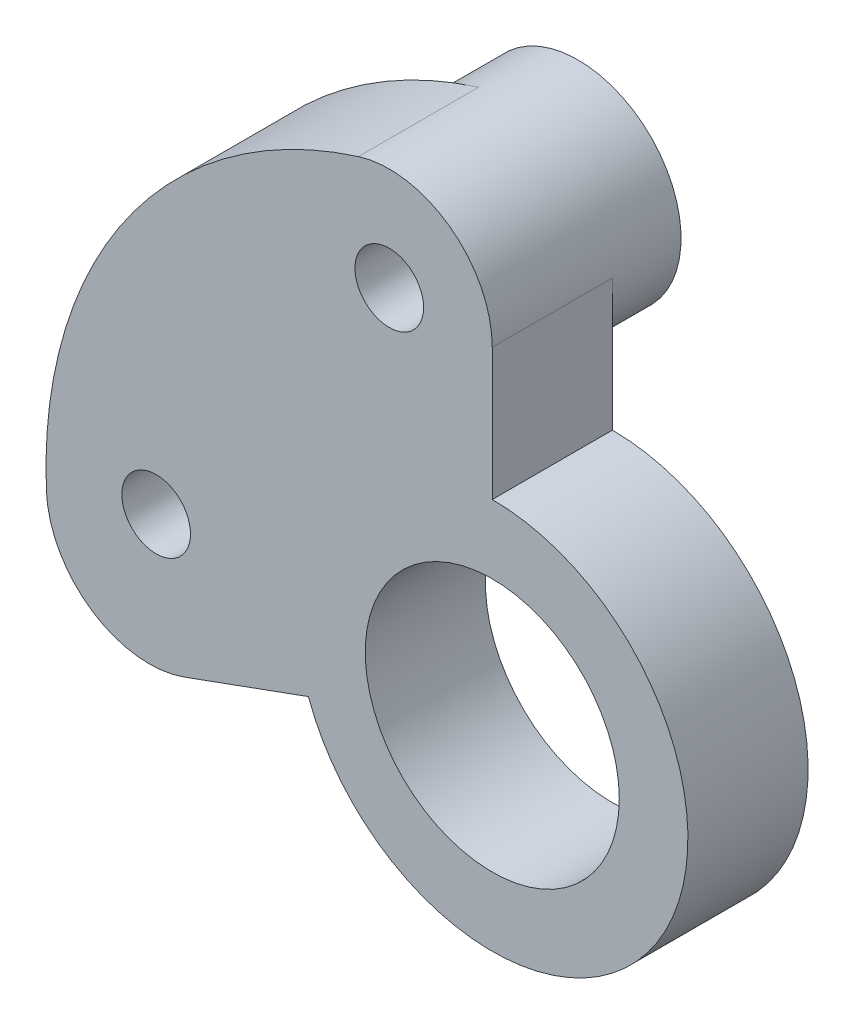
ISO-10303-21;
HEADER;
FILE_DESCRIPTION(('STEP AP214'),'2;1');
FILE_NAME('part.step','',(''),(''),'','','');
FILE_SCHEMA(('AUTOMOTIVE_DESIGN { 1 0 10303 214 1 1 1 1 }'));
ENDSEC;
DATA;
#1=APPLICATION_CONTEXT('core data for automotive mechanical design processes');
#2=APPLICATION_PROTOCOL_DEFINITION('international standard','automotive_design',2000,#1);
#3=PRODUCT_CONTEXT('',#1,'mechanical');
#4=PRODUCT('Part','Part','',(#3));
#5=PRODUCT_RELATED_PRODUCT_CATEGORY('part','',(#4));
#6=PRODUCT_DEFINITION_FORMATION('','',#4);
#7=PRODUCT_DEFINITION_CONTEXT('part definition',#1,'design');
#8=PRODUCT_DEFINITION('design','',#6,#7);
#9=PRODUCT_DEFINITION_SHAPE('','',#8);
#10=(LENGTH_UNIT() NAMED_UNIT(*) SI_UNIT(.MILLI.,.METRE.));
#11=(NAMED_UNIT(*) PLANE_ANGLE_UNIT() SI_UNIT($,.RADIAN.));
#12=(NAMED_UNIT(*) SI_UNIT($,.STERADIAN.) SOLID_ANGLE_UNIT());
#13=UNCERTAINTY_MEASURE_WITH_UNIT(LENGTH_MEASURE(1.E-05),#10,'distance_accuracy_value','');
#14=(GEOMETRIC_REPRESENTATION_CONTEXT(3) GLOBAL_UNCERTAINTY_ASSIGNED_CONTEXT((#13)) GLOBAL_UNIT_ASSIGNED_CONTEXT((#10,
#11,#12)) REPRESENTATION_CONTEXT('',''));
#15=CARTESIAN_POINT('',(0.,0.,0.));
#16=DIRECTION('',(0.,0.,1.));
#17=DIRECTION('',(1.,0.,0.));
#18=AXIS2_PLACEMENT_3D('',#15,#16,#17);
#19=CARTESIAN_POINT('',(0.,0.,0.));
#20=DIRECTION('',(0.,0.,1.));
#21=DIRECTION('',(1.,0.,0.));
#22=AXIS2_PLACEMENT_3D('',#19,#20,#21);
#23=PLANE('',#22);
#24=CARTESIAN_POINT('',(0.,0.,0.));
#25=DIRECTION('',(0.,0.,1.));
#26=DIRECTION('',(1.,0.,0.));
#27=AXIS2_PLACEMENT_3D('',#24,#25,#26);
#28=CIRCLE('',#27,3.7);
#29=CARTESIAN_POINT('',(3.7,0.,0.));
#30=VERTEX_POINT('',#29);
#31=EDGE_CURVE('E149',#30,#30,#28,.T.);
#32=ORIENTED_EDGE('',*,*,#31,.T.);
#33=EDGE_LOOP('',(#32));
#34=FACE_BOUND('',#33,.T.);
#35=CARTESIAN_POINT('',(-9.79035357822655,0.434714634336928,0.));
#36=DIRECTION('',(0.,0.,-1.));
#37=DIRECTION('',(-1.,0.,0.));
#38=AXIS2_PLACEMENT_3D('',#35,#36,#37);
#39=CIRCLE('',#38,3.);
#40=CARTESIAN_POINT('',(-12.7903535782265,0.434714634336928,0.));
#41=VERTEX_POINT('',#40);
#42=EDGE_CURVE('E11',#41,#41,#39,.T.);
#43=ORIENTED_EDGE('',*,*,#42,.F.);
#44=EDGE_LOOP('',(#43));
#45=FACE_BOUND('',#44,.T.);
#46=CARTESIAN_POINT('',(-3.,9.53939201416946,0.));
#47=DIRECTION('',(0.,0.,-1.));
#48=DIRECTION('',(-1.,0.,0.));
#49=AXIS2_PLACEMENT_3D('',#46,#47,#48);
#50=CIRCLE('',#49,3.);
#51=CARTESIAN_POINT('',(0.,9.53939201416946,0.));
#52=VERTEX_POINT('',#51);
#53=CARTESIAN_POINT('',(-3.9,12.4012096184203,0.));
#54=VERTEX_POINT('',#53);
#55=EDGE_CURVE('E102',#52,#54,#50,.T.);
#56=ORIENTED_EDGE('',*,*,#55,.F.);
#57=DIRECTION('',(0.,1.,0.));
#58=VECTOR('',#57,1.);
#59=CARTESIAN_POINT('',(0.,0.,0.));
#60=LINE('',#59,#58);
#61=CARTESIAN_POINT('',(0.,5.7,0.));
#62=VERTEX_POINT('',#61);
#63=EDGE_CURVE('E110',#62,#52,#60,.T.);
#64=ORIENTED_EDGE('',*,*,#63,.F.);
#65=CARTESIAN_POINT('',(0.,0.,0.));
#66=DIRECTION('',(0.,0.,1.));
#67=DIRECTION('',(1.,0.,0.));
#68=AXIS2_PLACEMENT_3D('',#65,#66,#67);
#69=CIRCLE('',#68,5.7);
#70=CARTESIAN_POINT('',(-5.3562479384797,-1.94951481695626,0.));
#71=VERTEX_POINT('',#70);
#72=EDGE_CURVE('E116',#71,#62,#69,.T.);
#73=ORIENTED_EDGE('',*,*,#72,.F.);
#74=DIRECTION('',(-0.939692620785912,-0.342020143325659,0.));
#75=VECTOR('',#74,1.);
#76=CARTESIAN_POINT('',(0.,0.,0.));
#77=LINE('',#76,#75);
#78=CARTESIAN_POINT('',(-8.9640962824991,-3.26266422392589,0.));
#79=VERTEX_POINT('',#78);
#80=EDGE_CURVE('E156',#71,#79,#77,.T.);
#81=ORIENTED_EDGE('',*,*,#80,.T.);
#82=CARTESIAN_POINT('',(-9.99015671247608,-0.443586361568155,0.));
#83=DIRECTION('',(0.,0.,1.));
#84=DIRECTION('',(1.,0.,0.));
#85=AXIS2_PLACEMENT_3D('',#82,#83,#84);
#86=CIRCLE('',#85,3.);
#87=CARTESIAN_POINT('',(-12.9872037262189,-0.576662270038601,0.));
#88=VERTEX_POINT('',#87);
#89=EDGE_CURVE('E107',#79,#88,#86,.F.);
#90=ORIENTED_EDGE('',*,*,#89,.T.);
#91=CARTESIAN_POINT('',(0.,0.,0.));
#92=DIRECTION('',(0.,0.,1.));
#93=DIRECTION('',(1.,0.,0.));
#94=AXIS2_PLACEMENT_3D('',#91,#92,#93);
#95=CIRCLE('',#94,13.);
#96=EDGE_CURVE('E120',#54,#88,#95,.T.);
#97=ORIENTED_EDGE('',*,*,#96,.F.);
#98=EDGE_LOOP('',(#56,#64,#73,#81,#90,#97));
#99=FACE_BOUND('',#98,.T.);
#100=ADVANCED_FACE('F43',(#34,#45,#99),#23,.F.);
#101=CARTESIAN_POINT('',(0.,0.,3.5));
#102=DIRECTION('',(0.,0.,-1.));
#103=DIRECTION('',(-1.,0.,0.));
#104=AXIS2_PLACEMENT_3D('',#101,#102,#103);
#105=CYLINDRICAL_SURFACE('',#104,13.);
#106=ORIENTED_EDGE('',*,*,#96,.T.);
#107=DIRECTION('',(0.,0.,-1.));
#108=VECTOR('',#107,1.);
#109=CARTESIAN_POINT('',(-12.9872037262189,-0.576662270038601,3.5));
#110=LINE('',#109,#108);
#111=CARTESIAN_POINT('',(-12.9872037262189,-0.576662270038601,3.5));
#112=VERTEX_POINT('',#111);
#113=EDGE_CURVE('E163',#88,#112,#110,.F.);
#114=ORIENTED_EDGE('',*,*,#113,.T.);
#115=CARTESIAN_POINT('',(0.,0.,3.5));
#116=DIRECTION('',(0.,0.,1.));
#117=DIRECTION('',(1.,0.,0.));
#118=AXIS2_PLACEMENT_3D('',#115,#116,#117);
#119=CIRCLE('',#118,13.);
#120=CARTESIAN_POINT('',(-3.9,12.4012096184203,3.5));
#121=VERTEX_POINT('',#120);
#122=EDGE_CURVE('E154',#121,#112,#119,.T.);
#123=ORIENTED_EDGE('',*,*,#122,.F.);
#124=DIRECTION('',(0.,0.,-1.));
#125=VECTOR('',#124,1.);
#126=CARTESIAN_POINT('',(-3.9,12.4012096184203,3.5));
#127=LINE('',#126,#125);
#128=EDGE_CURVE('E115',#121,#54,#127,.T.);
#129=ORIENTED_EDGE('',*,*,#128,.T.);
#130=EDGE_LOOP('',(#106,#114,#123,#129));
#131=FACE_BOUND('',#130,.T.);
#132=ADVANCED_FACE('F172',(#131),#105,.T.);
#133=CARTESIAN_POINT('',(0.,0.,3.5));
#134=DIRECTION('',(0.,0.,1.));
#135=DIRECTION('',(1.,0.,0.));
#136=AXIS2_PLACEMENT_3D('',#133,#134,#135);
#137=PLANE('',#136);
#138=CARTESIAN_POINT('',(-9.79035357822655,0.434714634336928,3.5));
#139=DIRECTION('',(0.,0.,1.));
#140=DIRECTION('',(1.,0.,0.));
#141=AXIS2_PLACEMENT_3D('',#138,#139,#140);
#142=CIRCLE('',#141,1.);
#143=CARTESIAN_POINT('',(-8.79035357822655,0.434714634336928,3.5));
#144=VERTEX_POINT('',#143);
#145=EDGE_CURVE('E133',#144,#144,#142,.T.);
#146=ORIENTED_EDGE('',*,*,#145,.F.);
#147=EDGE_LOOP('',(#146));
#148=FACE_BOUND('',#147,.T.);
#149=CARTESIAN_POINT('',(-3.,9.53939201416946,3.5));
#150=DIRECTION('',(0.,0.,1.));
#151=DIRECTION('',(1.,0.,0.));
#152=AXIS2_PLACEMENT_3D('',#149,#150,#151);
#153=CIRCLE('',#152,1.);
#154=CARTESIAN_POINT('',(-2.,9.53939201416946,3.5));
#155=VERTEX_POINT('',#154);
#156=EDGE_CURVE('E137',#155,#155,#153,.T.);
#157=ORIENTED_EDGE('',*,*,#156,.F.);
#158=EDGE_LOOP('',(#157));
#159=FACE_BOUND('',#158,.T.);
#160=CARTESIAN_POINT('',(0.,0.,3.5));
#161=DIRECTION('',(0.,0.,1.));
#162=DIRECTION('',(1.,0.,0.));
#163=AXIS2_PLACEMENT_3D('',#160,#161,#162);
#164=CIRCLE('',#163,3.7);
#165=CARTESIAN_POINT('',(3.7,0.,3.5));
#166=VERTEX_POINT('',#165);
#167=EDGE_CURVE('E151',#166,#166,#164,.T.);
#168=ORIENTED_EDGE('',*,*,#167,.F.);
#169=EDGE_LOOP('',(#168));
#170=FACE_BOUND('',#169,.T.);
#171=ORIENTED_EDGE('',*,*,#122,.T.);
#172=CARTESIAN_POINT('',(-9.99015671247608,-0.443586361568155,3.5));
#173=DIRECTION('',(0.,0.,1.));
#174=DIRECTION('',(1.,0.,0.));
#175=AXIS2_PLACEMENT_3D('',#172,#173,#174);
#176=CIRCLE('',#175,3.);
#177=CARTESIAN_POINT('',(-8.96409628249909,-3.26266422392589,3.5));
#178=VERTEX_POINT('',#177);
#179=EDGE_CURVE('E67',#112,#178,#176,.T.);
#180=ORIENTED_EDGE('',*,*,#179,.T.);
#181=DIRECTION('',(-0.939692620785912,-0.342020143325659,0.));
#182=VECTOR('',#181,1.);
#183=CARTESIAN_POINT('',(0.,0.,3.5));
#184=LINE('',#183,#182);
#185=CARTESIAN_POINT('',(-5.3562479384797,-1.94951481695626,3.5));
#186=VERTEX_POINT('',#185);
#187=EDGE_CURVE('E143',#186,#178,#184,.T.);
#188=ORIENTED_EDGE('',*,*,#187,.F.);
#189=CARTESIAN_POINT('',(0.,0.,3.5));
#190=DIRECTION('',(0.,0.,1.));
#191=DIRECTION('',(1.,0.,0.));
#192=AXIS2_PLACEMENT_3D('',#189,#190,#191);
#193=CIRCLE('',#192,5.7);
#194=CARTESIAN_POINT('',(0.,5.7,3.5));
#195=VERTEX_POINT('',#194);
#196=EDGE_CURVE('E140',#186,#195,#193,.T.);
#197=ORIENTED_EDGE('',*,*,#196,.T.);
#198=DIRECTION('',(0.,1.,0.));
#199=VECTOR('',#198,1.);
#200=CARTESIAN_POINT('',(0.,0.,3.5));
#201=LINE('',#200,#199);
#202=CARTESIAN_POINT('',(0.,9.53939201416946,3.5));
#203=VERTEX_POINT('',#202);
#204=EDGE_CURVE('E145',#195,#203,#201,.T.);
#205=ORIENTED_EDGE('',*,*,#204,.T.);
#206=CARTESIAN_POINT('',(-3.,9.53939201416946,3.5));
#207=DIRECTION('',(0.,0.,1.));
#208=DIRECTION('',(1.,0.,0.));
#209=AXIS2_PLACEMENT_3D('',#206,#207,#208);
#210=CIRCLE('',#209,3.);
#211=EDGE_CURVE('E103',#203,#121,#210,.T.);
#212=ORIENTED_EDGE('',*,*,#211,.T.);
#213=EDGE_LOOP('',(#171,#180,#188,#197,#205,#212));
#214=FACE_BOUND('',#213,.T.);
#215=ADVANCED_FACE('F192',(#148,#159,#170,#214),#137,.T.);
#216=CARTESIAN_POINT('',(0.,0.,3.5));
#217=DIRECTION('',(0.,0.,-1.));
#218=DIRECTION('',(-1.,0.,0.));
#219=AXIS2_PLACEMENT_3D('',#216,#217,#218);
#220=CYLINDRICAL_SURFACE('',#219,3.7);
#221=ORIENTED_EDGE('',*,*,#167,.T.);
#222=EDGE_LOOP('',(#221));
#223=FACE_BOUND('',#222,.T.);
#224=ORIENTED_EDGE('',*,*,#31,.F.);
#225=EDGE_LOOP('',(#224));
#226=FACE_BOUND('',#225,.T.);
#227=ADVANCED_FACE('F197',(#223,#226),#220,.F.);
#228=CARTESIAN_POINT('',(0.,0.,-6.5));
#229=DIRECTION('',(0.,0.,1.));
#230=DIRECTION('',(1.,0.,0.));
#231=AXIS2_PLACEMENT_3D('',#228,#229,#230);
#232=CYLINDRICAL_SURFACE('',#231,5.7);
#233=ORIENTED_EDGE('',*,*,#72,.T.);
#234=DIRECTION('',(0.,0.,1.));
#235=VECTOR('',#234,1.);
#236=CARTESIAN_POINT('',(0.,5.7,-6.5));
#237=LINE('',#236,#235);
#238=EDGE_CURVE('E112',#62,#195,#237,.T.);
#239=ORIENTED_EDGE('',*,*,#238,.T.);
#240=ORIENTED_EDGE('',*,*,#196,.F.);
#241=DIRECTION('',(0.,0.,1.));
#242=VECTOR('',#241,1.);
#243=CARTESIAN_POINT('',(-5.3562479384797,-1.94951481695626,-6.5));
#244=LINE('',#243,#242);
#245=EDGE_CURVE('E147',#71,#186,#244,.T.);
#246=ORIENTED_EDGE('',*,*,#245,.F.);
#247=EDGE_LOOP('',(#233,#239,#240,#246));
#248=FACE_BOUND('',#247,.T.);
#249=ADVANCED_FACE('F199',(#248),#232,.T.);
#250=CARTESIAN_POINT('',(0.,0.,-6.5));
#251=DIRECTION('',(1.,0.,0.));
#252=DIRECTION('',(0.,0.,-1.));
#253=AXIS2_PLACEMENT_3D('',#250,#251,#252);
#254=PLANE('',#253);
#255=ORIENTED_EDGE('',*,*,#63,.T.);
#256=DIRECTION('',(0.,0.,1.));
#257=VECTOR('',#256,1.);
#258=CARTESIAN_POINT('',(0.,9.53939201416946,3.5));
#259=LINE('',#258,#257);
#260=EDGE_CURVE('E47',#52,#203,#259,.T.);
#261=ORIENTED_EDGE('',*,*,#260,.T.);
#262=ORIENTED_EDGE('',*,*,#204,.F.);
#263=ORIENTED_EDGE('',*,*,#238,.F.);
#264=EDGE_LOOP('',(#255,#261,#262,#263));
#265=FACE_BOUND('',#264,.T.);
#266=ADVANCED_FACE('F111',(#265),#254,.T.);
#267=CARTESIAN_POINT('',(0.,0.,-6.5));
#268=DIRECTION('',(-0.342020143325659,0.939692620785912,0.));
#269=DIRECTION('',(-0.939692620785912,-0.342020143325659,0.));
#270=AXIS2_PLACEMENT_3D('',#267,#268,#269);
#271=PLANE('',#270);
#272=ORIENTED_EDGE('',*,*,#187,.T.);
#273=DIRECTION('',(0.,0.,-1.));
#274=VECTOR('',#273,1.);
#275=CARTESIAN_POINT('',(-8.9640962824991,-3.26266422392589,-6.5));
#276=LINE('',#275,#274);
#277=EDGE_CURVE('E59',#178,#79,#276,.T.);
#278=ORIENTED_EDGE('',*,*,#277,.T.);
#279=ORIENTED_EDGE('',*,*,#80,.F.);
#280=ORIENTED_EDGE('',*,*,#245,.T.);
#281=EDGE_LOOP('',(#272,#278,#279,#280));
#282=FACE_BOUND('',#281,.T.);
#283=ADVANCED_FACE('F213',(#282),#271,.F.);
#284=CARTESIAN_POINT('',(-3.,9.53939201416946,-6.5));
#285=DIRECTION('',(0.,0.,1.));
#286=DIRECTION('',(1.,0.,0.));
#287=AXIS2_PLACEMENT_3D('',#284,#285,#286);
#288=CYLINDRICAL_SURFACE('',#287,1.);
#289=ORIENTED_EDGE('',*,*,#156,.T.);
#290=EDGE_LOOP('',(#289));
#291=FACE_BOUND('',#290,.T.);
#292=CARTESIAN_POINT('',(-3.,9.53939201416946,-2.));
#293=DIRECTION('',(0.,0.,-1.));
#294=DIRECTION('',(-1.,0.,0.));
#295=AXIS2_PLACEMENT_3D('',#292,#293,#294);
#296=CIRCLE('',#295,1.);
#297=CARTESIAN_POINT('',(-4.,9.53939201416946,-2.));
#298=VERTEX_POINT('',#297);
#299=EDGE_CURVE('E121',#298,#298,#296,.F.);
#300=ORIENTED_EDGE('',*,*,#299,.F.);
#301=EDGE_LOOP('',(#300));
#302=FACE_BOUND('',#301,.T.);
#303=ADVANCED_FACE('F182',(#291,#302),#288,.F.);
#304=CARTESIAN_POINT('',(-9.79035357822655,0.434714634336928,-2.5));
#305=DIRECTION('',(0.,0.,1.));
#306=DIRECTION('',(1.,0.,0.));
#307=AXIS2_PLACEMENT_3D('',#304,#305,#306);
#308=CYLINDRICAL_SURFACE('',#307,1.);
#309=ORIENTED_EDGE('',*,*,#145,.T.);
#310=EDGE_LOOP('',(#309));
#311=FACE_BOUND('',#310,.T.);
#312=CARTESIAN_POINT('',(-9.79035357822655,0.434714634336928,-0.5));
#313=DIRECTION('',(0.,0.,-1.));
#314=DIRECTION('',(-1.,0.,0.));
#315=AXIS2_PLACEMENT_3D('',#312,#313,#314);
#316=CIRCLE('',#315,1.);
#317=CARTESIAN_POINT('',(-10.7903535782265,0.434714634336928,-0.5));
#318=VERTEX_POINT('',#317);
#319=EDGE_CURVE('E128',#318,#318,#316,.F.);
#320=ORIENTED_EDGE('',*,*,#319,.F.);
#321=EDGE_LOOP('',(#320));
#322=FACE_BOUND('',#321,.T.);
#323=ADVANCED_FACE('F176',(#311,#322),#308,.F.);
#324=CARTESIAN_POINT('',(-9.99015671247608,-0.443586361568155,3.5));
#325=DIRECTION('',(0.,0.,-1.));
#326=DIRECTION('',(-1.,0.,0.));
#327=AXIS2_PLACEMENT_3D('',#324,#325,#326);
#328=CYLINDRICAL_SURFACE('',#327,3.);
#329=ORIENTED_EDGE('',*,*,#89,.F.);
#330=ORIENTED_EDGE('',*,*,#277,.F.);
#331=ORIENTED_EDGE('',*,*,#179,.F.);
#332=ORIENTED_EDGE('',*,*,#113,.F.);
#333=EDGE_LOOP('',(#329,#330,#331,#332));
#334=FACE_BOUND('',#333,.T.);
#335=ADVANCED_FACE('F174',(#334),#328,.T.);
#336=CARTESIAN_POINT('',(-3.,9.53939201416946,3.5));
#337=DIRECTION('',(0.,0.,-1.));
#338=DIRECTION('',(-1.,0.,0.));
#339=AXIS2_PLACEMENT_3D('',#336,#337,#338);
#340=CYLINDRICAL_SURFACE('',#339,3.);
#341=ORIENTED_EDGE('',*,*,#260,.F.);
#342=ORIENTED_EDGE('',*,*,#55,.T.);
#343=ORIENTED_EDGE('',*,*,#128,.F.);
#344=ORIENTED_EDGE('',*,*,#211,.F.);
#345=EDGE_LOOP('',(#341,#342,#343,#344));
#346=FACE_BOUND('',#345,.T.);
#347=CARTESIAN_POINT('',(-3.,9.53939201416946,-2.));
#348=DIRECTION('',(0.,0.,-1.));
#349=DIRECTION('',(-1.,0.,0.));
#350=AXIS2_PLACEMENT_3D('',#347,#348,#349);
#351=CIRCLE('',#350,3.);
#352=CARTESIAN_POINT('',(-6.,9.53939201416946,-2.));
#353=VERTEX_POINT('',#352);
#354=EDGE_CURVE('E124',#353,#353,#351,.T.);
#355=ORIENTED_EDGE('',*,*,#354,.F.);
#356=EDGE_LOOP('',(#355));
#357=FACE_BOUND('',#356,.T.);
#358=ADVANCED_FACE('F45',(#346,#357),#340,.T.);
#359=CARTESIAN_POINT('',(-9.79035357822655,0.434714634336928,-0.5));
#360=DIRECTION('',(0.,0.,1.));
#361=DIRECTION('',(1.,0.,0.));
#362=AXIS2_PLACEMENT_3D('',#359,#360,#361);
#363=CYLINDRICAL_SURFACE('',#362,3.);
#364=CARTESIAN_POINT('',(-9.79035357822655,0.434714634336928,-0.5));
#365=DIRECTION('',(0.,0.,-1.));
#366=DIRECTION('',(-1.,0.,0.));
#367=AXIS2_PLACEMENT_3D('',#364,#365,#366);
#368=CIRCLE('',#367,3.);
#369=CARTESIAN_POINT('',(-12.7903535782265,0.434714634336928,-0.5));
#370=VERTEX_POINT('',#369);
#371=EDGE_CURVE('E131',#370,#370,#368,.T.);
#372=ORIENTED_EDGE('',*,*,#371,.F.);
#373=EDGE_LOOP('',(#372));
#374=FACE_BOUND('',#373,.T.);
#375=ORIENTED_EDGE('',*,*,#42,.T.);
#376=EDGE_LOOP('',(#375));
#377=FACE_BOUND('',#376,.T.);
#378=ADVANCED_FACE('F181',(#374,#377),#363,.T.);
#379=CARTESIAN_POINT('',(0.,0.,-0.5));
#380=DIRECTION('',(0.,0.,-1.));
#381=DIRECTION('',(-1.,0.,0.));
#382=AXIS2_PLACEMENT_3D('',#379,#380,#381);
#383=PLANE('',#382);
#384=ORIENTED_EDGE('',*,*,#319,.T.);
#385=EDGE_LOOP('',(#384));
#386=FACE_BOUND('',#385,.T.);
#387=ORIENTED_EDGE('',*,*,#371,.T.);
#388=EDGE_LOOP('',(#387));
#389=FACE_BOUND('',#388,.T.);
#390=ADVANCED_FACE('F226',(#386,#389),#383,.T.);
#391=CARTESIAN_POINT('',(0.,0.,-2.));
#392=DIRECTION('',(0.,0.,-1.));
#393=DIRECTION('',(-1.,0.,0.));
#394=AXIS2_PLACEMENT_3D('',#391,#392,#393);
#395=PLANE('',#394);
#396=ORIENTED_EDGE('',*,*,#299,.T.);
#397=EDGE_LOOP('',(#396));
#398=FACE_BOUND('',#397,.T.);
#399=ORIENTED_EDGE('',*,*,#354,.T.);
#400=EDGE_LOOP('',(#399));
#401=FACE_BOUND('',#400,.T.);
#402=ADVANCED_FACE('F230',(#398,#401),#395,.T.);
#403=CLOSED_SHELL('',(#100,#132,#215,#227,#249,#266,#283,#303,#323,#335,#358,#378,#390,#402));
#404=MANIFOLD_SOLID_BREP('B2',#403);
#405=ADVANCED_BREP_SHAPE_REPRESENTATION('',(#18,#404),#14);
#406=SHAPE_DEFINITION_REPRESENTATION(#9,#405);
ENDSEC;
END-ISO-10303-21;
